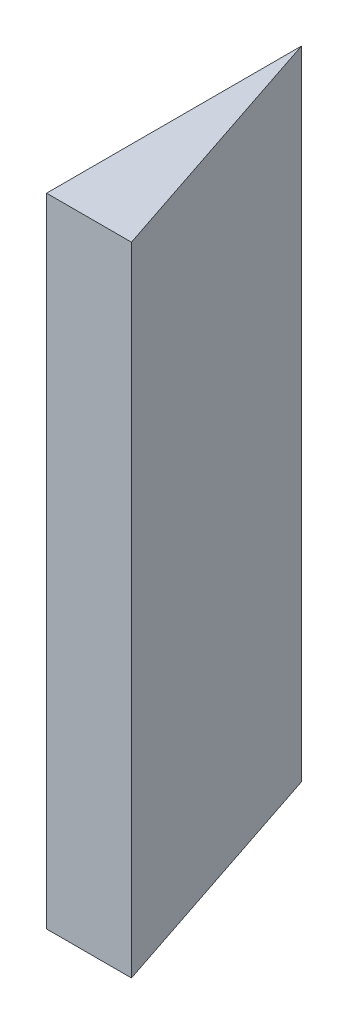
ISO-10303-21;
HEADER;
FILE_DESCRIPTION(('STEP AP214'),'2;1');
FILE_NAME('part.step','',(''),(''),'','','');
FILE_SCHEMA(('AUTOMOTIVE_DESIGN { 1 0 10303 214 1 1 1 1 }'));
ENDSEC;
DATA;
#1=APPLICATION_CONTEXT('core data for automotive mechanical design processes');
#2=APPLICATION_PROTOCOL_DEFINITION('international standard','automotive_design',2000,#1);
#3=PRODUCT_CONTEXT('',#1,'mechanical');
#4=PRODUCT('Part','Part','',(#3));
#5=PRODUCT_RELATED_PRODUCT_CATEGORY('part','',(#4));
#6=PRODUCT_DEFINITION_FORMATION('','',#4);
#7=PRODUCT_DEFINITION_CONTEXT('part definition',#1,'design');
#8=PRODUCT_DEFINITION('design','',#6,#7);
#9=PRODUCT_DEFINITION_SHAPE('','',#8);
#10=(LENGTH_UNIT() NAMED_UNIT(*) SI_UNIT(.MILLI.,.METRE.));
#11=(NAMED_UNIT(*) PLANE_ANGLE_UNIT() SI_UNIT($,.RADIAN.));
#12=(NAMED_UNIT(*) SI_UNIT($,.STERADIAN.) SOLID_ANGLE_UNIT());
#13=UNCERTAINTY_MEASURE_WITH_UNIT(LENGTH_MEASURE(1.E-05),#10,'distance_accuracy_value','');
#14=(GEOMETRIC_REPRESENTATION_CONTEXT(3) GLOBAL_UNCERTAINTY_ASSIGNED_CONTEXT((#13)) GLOBAL_UNIT_ASSIGNED_CONTEXT((#10,
#11,#12)) REPRESENTATION_CONTEXT('',''));
#15=CARTESIAN_POINT('',(0.,0.,0.));
#16=DIRECTION('',(0.,0.,1.));
#17=DIRECTION('',(1.,0.,0.));
#18=AXIS2_PLACEMENT_3D('',#15,#16,#17);
#19=CARTESIAN_POINT('',(-3.91999969402027,1.75000086723294,-3.67112167398598));
#20=DIRECTION('',(-1.74845553146952E-07,-1.,8.74227765734759E-08));
#21=DIRECTION('',(1.,-1.74845553146952E-07,0.));
#22=AXIS2_PLACEMENT_3D('',#19,#20,#21);
#23=PLANE('',#22);
#24=DIRECTION('',(0.,-8.74227767955203E-08,-0.999999999999996));
#25=VECTOR('',#24,1.);
#26=CARTESIAN_POINT('',(-3.89999969402026,1.7500009004536,-3.25112167398598));
#27=LINE('',#26,#25);
#28=CARTESIAN_POINT('',(-3.89999969402026,1.7500009004526,-3.25112167398598));
#29=VERTEX_POINT('',#28);
#30=CARTESIAN_POINT('',(-3.89999969402027,1.75000086548349,-3.65112167398598));
#31=VERTEX_POINT('',#30);
#32=EDGE_CURVE('E11',#29,#31,#27,.T.);
#33=ORIENTED_EDGE('',*,*,#32,.F.);
#34=DIRECTION('',(-0.999999999999985,1.74845553322983E-07,0.));
#35=VECTOR('',#34,1.);
#36=CARTESIAN_POINT('',(-3.76677751937626,1.75000087716029,-3.25112167398598));
#37=LINE('',#36,#35);
#38=CARTESIAN_POINT('',(-3.76677751937626,1.75000087715929,-3.25112167398598));
#39=VERTEX_POINT('',#38);
#40=EDGE_CURVE('E63',#39,#29,#37,.T.);
#41=ORIENTED_EDGE('',*,*,#40,.F.);
#42=DIRECTION('',(0.315990463967212,2.76939130166601E-08,0.948762365759617));
#43=VECTOR('',#42,1.);
#44=CARTESIAN_POINT('',(-3.89999969402027,1.75000086548449,-3.65112167398598));
#45=LINE('',#44,#43);
#46=EDGE_CURVE('E70',#31,#39,#45,.T.);
#47=ORIENTED_EDGE('',*,*,#46,.F.);
#48=EDGE_LOOP('',(#33,#41,#47));
#49=FACE_BOUND('',#48,.T.);
#50=ADVANCED_FACE('F17',(#49),#23,.F.);
#51=CARTESIAN_POINT('',(-3.91999986886582,0.750000867232944,-3.67112158656321));
#52=DIRECTION('',(-1.74845553146952E-07,-1.,8.74227765734759E-08));
#53=DIRECTION('',(1.,-1.74845553146952E-07,0.));
#54=AXIS2_PLACEMENT_3D('',#51,#52,#53);
#55=PLANE('',#54);
#56=DIRECTION('',(0.315990463967212,2.76939130166601E-08,0.948762365759617));
#57=VECTOR('',#56,1.);
#58=CARTESIAN_POINT('',(-3.89999986886582,0.750000865484488,-3.65112158656321));
#59=LINE('',#58,#57);
#60=CARTESIAN_POINT('',(-3.89999986886582,0.750000865485488,-3.65112158656321));
#61=VERTEX_POINT('',#60);
#62=CARTESIAN_POINT('',(-3.76677769422182,0.750000877161294,-3.25112158656321));
#63=VERTEX_POINT('',#62);
#64=EDGE_CURVE('E24',#61,#63,#59,.T.);
#65=ORIENTED_EDGE('',*,*,#64,.T.);
#66=DIRECTION('',(-0.999999999999985,1.74845553322982E-07,0.));
#67=VECTOR('',#66,1.);
#68=CARTESIAN_POINT('',(-3.76677769422182,0.750000877160294,-3.2511215865632));
#69=LINE('',#68,#67);
#70=CARTESIAN_POINT('',(-3.89999986886582,0.750000900454599,-3.25112158656321));
#71=VERTEX_POINT('',#70);
#72=EDGE_CURVE('E49',#63,#71,#69,.T.);
#73=ORIENTED_EDGE('',*,*,#72,.T.);
#74=DIRECTION('',(0.,-8.74227767955202E-08,-0.999999999999996));
#75=VECTOR('',#74,1.);
#76=CARTESIAN_POINT('',(-3.89999986886582,0.750000900453599,-3.25112158656321));
#77=LINE('',#76,#75);
#78=EDGE_CURVE('E46',#71,#61,#77,.T.);
#79=ORIENTED_EDGE('',*,*,#78,.T.);
#80=EDGE_LOOP('',(#65,#73,#79));
#81=FACE_BOUND('',#80,.T.);
#82=ADVANCED_FACE('F47',(#81),#55,.T.);
#83=CARTESIAN_POINT('',(-3.89999969402027,1.75000086548449,-3.65112167398598));
#84=DIRECTION('',(0.948762365759617,-1.93511644350672E-07,-0.315990463967199));
#85=DIRECTION('',(0.315990463967214,2.76939128616174E-08,0.948762365759622));
#86=AXIS2_PLACEMENT_3D('',#83,#84,#85);
#87=PLANE('',#86);
#88=ORIENTED_EDGE('',*,*,#46,.T.);
#89=DIRECTION('',(-1.74845553146948E-07,-0.999999999999981,8.74227765734742E-08));
#90=VECTOR('',#89,1.);
#91=CARTESIAN_POINT('',(-3.76677751937626,1.75000087716029,-3.25112167398598));
#92=LINE('',#91,#90);
#93=EDGE_CURVE('E54',#39,#63,#92,.T.);
#94=ORIENTED_EDGE('',*,*,#93,.T.);
#95=ORIENTED_EDGE('',*,*,#64,.F.);
#96=DIRECTION('',(-1.74845553146948E-07,-0.999999999999981,8.74227765734742E-08));
#97=VECTOR('',#96,1.);
#98=CARTESIAN_POINT('',(-3.89999969402027,1.75000086548449,-3.65112167398598));
#99=LINE('',#98,#97);
#100=EDGE_CURVE('E61',#31,#61,#99,.T.);
#101=ORIENTED_EDGE('',*,*,#100,.F.);
#102=EDGE_LOOP('',(#88,#94,#95,#101));
#103=FACE_BOUND('',#102,.T.);
#104=ADVANCED_FACE('F60',(#103),#87,.T.);
#105=CARTESIAN_POINT('',(-3.76677751937626,1.75000087716029,-3.25112167398598));
#106=DIRECTION('',(0.,8.74227765734759E-08,1.));
#107=DIRECTION('',(-1.,1.74845553146952E-07,0.));
#108=AXIS2_PLACEMENT_3D('',#105,#106,#107);
#109=PLANE('',#108);
#110=ORIENTED_EDGE('',*,*,#40,.T.);
#111=DIRECTION('',(-1.74845553146948E-07,-0.999999999999981,8.74227765734742E-08));
#112=VECTOR('',#111,1.);
#113=CARTESIAN_POINT('',(-3.89999969402026,1.7500009004536,-3.25112167398598));
#114=LINE('',#113,#112);
#115=EDGE_CURVE('E55',#29,#71,#114,.T.);
#116=ORIENTED_EDGE('',*,*,#115,.T.);
#117=ORIENTED_EDGE('',*,*,#72,.F.);
#118=ORIENTED_EDGE('',*,*,#93,.F.);
#119=EDGE_LOOP('',(#110,#116,#117,#118));
#120=FACE_BOUND('',#119,.T.);
#121=ADVANCED_FACE('F73',(#120),#109,.T.);
#122=CARTESIAN_POINT('',(-3.89999969402026,1.7500009004536,-3.25112167398598));
#123=DIRECTION('',(-1.,1.74845553146952E-07,0.));
#124=DIRECTION('',(0.,-8.74227765734759E-08,-1.));
#125=AXIS2_PLACEMENT_3D('',#122,#123,#124);
#126=PLANE('',#125);
#127=ORIENTED_EDGE('',*,*,#32,.T.);
#128=ORIENTED_EDGE('',*,*,#100,.T.);
#129=ORIENTED_EDGE('',*,*,#78,.F.);
#130=ORIENTED_EDGE('',*,*,#115,.F.);
#131=EDGE_LOOP('',(#127,#128,#129,#130));
#132=FACE_BOUND('',#131,.T.);
#133=ADVANCED_FACE('F64',(#132),#126,.T.);
#134=CLOSED_SHELL('',(#50,#82,#104,#121,#133));
#135=MANIFOLD_SOLID_BREP('B1',#134);
#136=ADVANCED_BREP_SHAPE_REPRESENTATION('',(#18,#135),#14);
#137=SHAPE_DEFINITION_REPRESENTATION(#9,#136);
ENDSEC;
END-ISO-10303-21;
